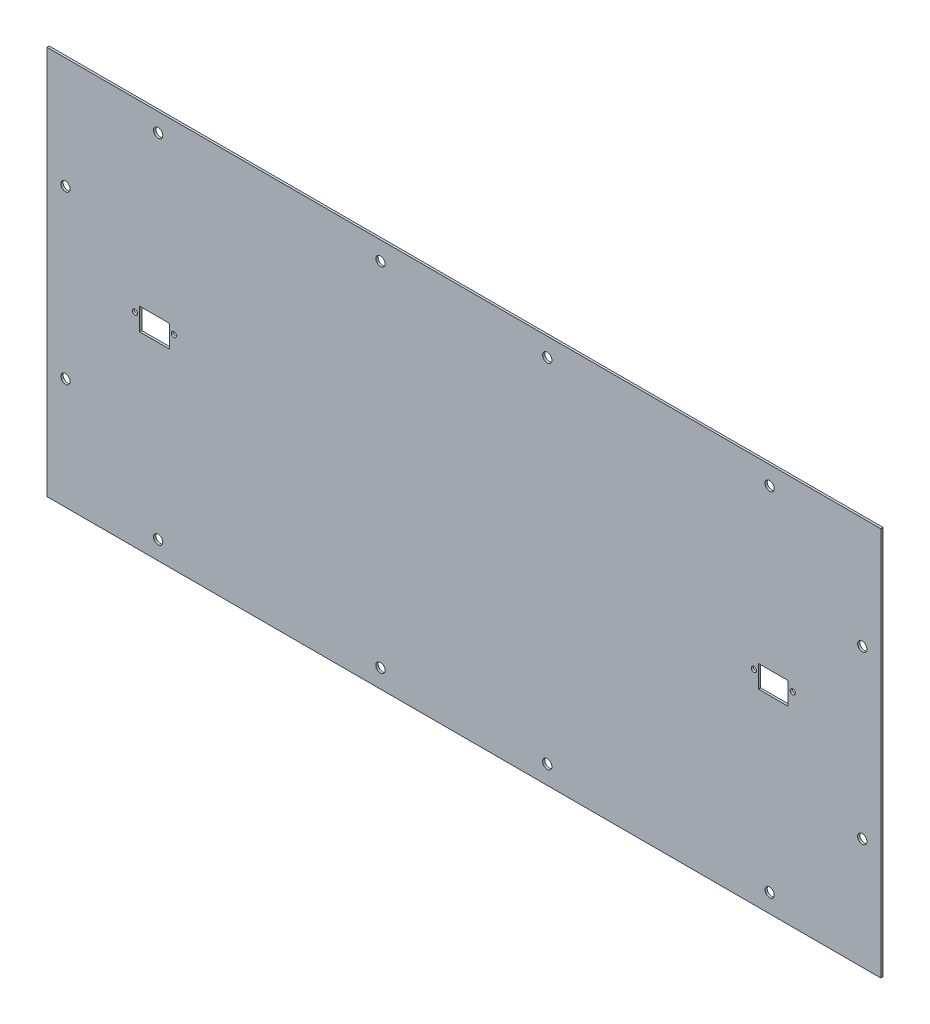
ISO-10303-21;
HEADER;
FILE_DESCRIPTION(('STEP AP214'),'2;1');
FILE_NAME('part.step','',(''),(''),'','','');
FILE_SCHEMA(('AUTOMOTIVE_DESIGN { 1 0 10303 214 1 1 1 1 }'));
ENDSEC;
DATA;
#1=APPLICATION_CONTEXT('core data for automotive mechanical design processes');
#2=APPLICATION_PROTOCOL_DEFINITION('international standard','automotive_design',2000,#1);
#3=PRODUCT_CONTEXT('',#1,'mechanical');
#4=PRODUCT('Part','Part','',(#3));
#5=PRODUCT_RELATED_PRODUCT_CATEGORY('part','',(#4));
#6=PRODUCT_DEFINITION_FORMATION('','',#4);
#7=PRODUCT_DEFINITION_CONTEXT('part definition',#1,'design');
#8=PRODUCT_DEFINITION('design','',#6,#7);
#9=PRODUCT_DEFINITION_SHAPE('','',#8);
#10=(LENGTH_UNIT() NAMED_UNIT(*) SI_UNIT(.MILLI.,.METRE.));
#11=(NAMED_UNIT(*) PLANE_ANGLE_UNIT() SI_UNIT($,.RADIAN.));
#12=(NAMED_UNIT(*) SI_UNIT($,.STERADIAN.) SOLID_ANGLE_UNIT());
#13=UNCERTAINTY_MEASURE_WITH_UNIT(LENGTH_MEASURE(1.E-05),#10,'distance_accuracy_value','');
#14=(GEOMETRIC_REPRESENTATION_CONTEXT(3) GLOBAL_UNCERTAINTY_ASSIGNED_CONTEXT((#13)) GLOBAL_UNIT_ASSIGNED_CONTEXT((#10,
#11,#12)) REPRESENTATION_CONTEXT('',''));
#15=CARTESIAN_POINT('',(0.,0.,0.));
#16=DIRECTION('',(0.,0.,1.));
#17=DIRECTION('',(1.,0.,0.));
#18=AXIS2_PLACEMENT_3D('',#15,#16,#17);
#19=CARTESIAN_POINT('',(0.,0.,-1.2));
#20=DIRECTION('',(0.,0.,-1.));
#21=DIRECTION('',(-1.,0.,0.));
#22=AXIS2_PLACEMENT_3D('',#19,#20,#21);
#23=PLANE('',#22);
#24=CARTESIAN_POINT('',(440.,60.0000000000001,-1.2));
#25=DIRECTION('',(0.,0.,1.));
#26=DIRECTION('',(1.,0.,0.));
#27=AXIS2_PLACEMENT_3D('',#24,#25,#26);
#28=CIRCLE('',#27,2.50000000000002);
#29=CARTESIAN_POINT('',(442.5,60.0000000000001,-1.2));
#30=VERTEX_POINT('',#29);
#31=EDGE_CURVE('E291',#30,#30,#28,.T.);
#32=ORIENTED_EDGE('',*,*,#31,.T.);
#33=EDGE_LOOP('',(#32));
#34=FACE_BOUND('',#33,.T.);
#35=CARTESIAN_POINT('',(180.,200.,-1.2));
#36=DIRECTION('',(0.,0.,1.));
#37=DIRECTION('',(1.,0.,0.));
#38=AXIS2_PLACEMENT_3D('',#35,#36,#37);
#39=CIRCLE('',#38,2.50000000000002);
#40=CARTESIAN_POINT('',(182.5,200.,-1.2));
#41=VERTEX_POINT('',#40);
#42=EDGE_CURVE('E303',#41,#41,#39,.T.);
#43=ORIENTED_EDGE('',*,*,#42,.T.);
#44=EDGE_LOOP('',(#43));
#45=FACE_BOUND('',#44,.T.);
#46=CARTESIAN_POINT('',(60.,200.,-1.2));
#47=DIRECTION('',(0.,0.,1.));
#48=DIRECTION('',(1.,0.,0.));
#49=AXIS2_PLACEMENT_3D('',#46,#47,#48);
#50=CIRCLE('',#49,2.5);
#51=CARTESIAN_POINT('',(62.5,200.,-1.2));
#52=VERTEX_POINT('',#51);
#53=EDGE_CURVE('E306',#52,#52,#50,.T.);
#54=ORIENTED_EDGE('',*,*,#53,.T.);
#55=EDGE_LOOP('',(#54));
#56=FACE_BOUND('',#55,.T.);
#57=CARTESIAN_POINT('',(10.,150.,-1.2));
#58=DIRECTION('',(0.,0.,1.));
#59=DIRECTION('',(1.,0.,0.));
#60=AXIS2_PLACEMENT_3D('',#57,#58,#59);
#61=CIRCLE('',#60,2.50000000000002);
#62=CARTESIAN_POINT('',(12.5,150.,-1.2));
#63=VERTEX_POINT('',#62);
#64=EDGE_CURVE('E309',#63,#63,#61,.T.);
#65=ORIENTED_EDGE('',*,*,#64,.T.);
#66=EDGE_LOOP('',(#65));
#67=FACE_BOUND('',#66,.T.);
#68=CARTESIAN_POINT('',(270.,10.,-1.2));
#69=DIRECTION('',(0.,0.,1.));
#70=DIRECTION('',(1.,0.,0.));
#71=AXIS2_PLACEMENT_3D('',#68,#69,#70);
#72=CIRCLE('',#71,2.50000000000002);
#73=CARTESIAN_POINT('',(272.5,10.,-1.2));
#74=VERTEX_POINT('',#73);
#75=EDGE_CURVE('E290',#74,#74,#72,.T.);
#76=ORIENTED_EDGE('',*,*,#75,.T.);
#77=EDGE_LOOP('',(#76));
#78=FACE_BOUND('',#77,.T.);
#79=CARTESIAN_POINT('',(390.,10.0000000000001,-1.2));
#80=DIRECTION('',(0.,0.,1.));
#81=DIRECTION('',(1.,0.,0.));
#82=AXIS2_PLACEMENT_3D('',#79,#80,#81);
#83=CIRCLE('',#82,2.50000000000002);
#84=CARTESIAN_POINT('',(392.5,10.0000000000001,-1.2));
#85=VERTEX_POINT('',#84);
#86=EDGE_CURVE('E241',#85,#85,#83,.T.);
#87=ORIENTED_EDGE('',*,*,#86,.T.);
#88=EDGE_LOOP('',(#87));
#89=FACE_BOUND('',#88,.T.);
#90=CARTESIAN_POINT('',(402.5,110.,-1.2));
#91=DIRECTION('',(0.,0.,-1.));
#92=DIRECTION('',(-1.,0.,0.));
#93=AXIS2_PLACEMENT_3D('',#90,#91,#92);
#94=CIRCLE('',#93,1.40000000000003);
#95=CARTESIAN_POINT('',(401.1,110.,-1.2));
#96=VERTEX_POINT('',#95);
#97=EDGE_CURVE('E229',#96,#96,#94,.T.);
#98=ORIENTED_EDGE('',*,*,#97,.F.);
#99=EDGE_LOOP('',(#98));
#100=FACE_BOUND('',#99,.T.);
#101=CARTESIAN_POINT('',(381.5,110.,-1.2));
#102=DIRECTION('',(0.,0.,-1.));
#103=DIRECTION('',(-1.,0.,0.));
#104=AXIS2_PLACEMENT_3D('',#101,#102,#103);
#105=CIRCLE('',#104,1.40000000000003);
#106=CARTESIAN_POINT('',(380.1,110.,-1.2));
#107=VERTEX_POINT('',#106);
#108=EDGE_CURVE('E281',#107,#107,#105,.T.);
#109=ORIENTED_EDGE('',*,*,#108,.F.);
#110=EDGE_LOOP('',(#109));
#111=FACE_BOUND('',#110,.T.);
#112=CARTESIAN_POINT('',(68.5,110.,-1.2));
#113=DIRECTION('',(0.,0.,-1.));
#114=DIRECTION('',(1.,0.,0.));
#115=AXIS2_PLACEMENT_3D('',#112,#113,#114);
#116=CIRCLE('',#115,1.40000000000003);
#117=CARTESIAN_POINT('',(69.9,110.,-1.2));
#118=VERTEX_POINT('',#117);
#119=EDGE_CURVE('E276',#118,#118,#116,.T.);
#120=ORIENTED_EDGE('',*,*,#119,.F.);
#121=EDGE_LOOP('',(#120));
#122=FACE_BOUND('',#121,.T.);
#123=CARTESIAN_POINT('',(47.5,110.,-1.2));
#124=DIRECTION('',(0.,0.,-1.));
#125=DIRECTION('',(1.,0.,0.));
#126=AXIS2_PLACEMENT_3D('',#123,#124,#125);
#127=CIRCLE('',#126,1.40000000000003);
#128=CARTESIAN_POINT('',(48.9,110.,-1.2));
#129=VERTEX_POINT('',#128);
#130=EDGE_CURVE('E272',#129,#129,#127,.T.);
#131=ORIENTED_EDGE('',*,*,#130,.F.);
#132=EDGE_LOOP('',(#131));
#133=FACE_BOUND('',#132,.T.);
#134=DIRECTION('',(0.,-1.,0.));
#135=VECTOR('',#134,1.);
#136=CARTESIAN_POINT('',(400.,114.,-1.2));
#137=LINE('',#136,#135);
#138=CARTESIAN_POINT('',(400.,114.,-1.2));
#139=VERTEX_POINT('',#138);
#140=CARTESIAN_POINT('',(400.,102.,-1.2));
#141=VERTEX_POINT('',#140);
#142=EDGE_CURVE('E51',#139,#141,#137,.T.);
#143=ORIENTED_EDGE('',*,*,#142,.F.);
#144=DIRECTION('',(1.,0.,0.));
#145=VECTOR('',#144,1.);
#146=CARTESIAN_POINT('',(400.,114.,-1.2));
#147=LINE('',#146,#145);
#148=CARTESIAN_POINT('',(384.,114.,-1.2));
#149=VERTEX_POINT('',#148);
#150=EDGE_CURVE('E148',#149,#139,#147,.T.);
#151=ORIENTED_EDGE('',*,*,#150,.F.);
#152=DIRECTION('',(0.,1.,0.));
#153=VECTOR('',#152,1.);
#154=CARTESIAN_POINT('',(384.,114.,-1.2));
#155=LINE('',#154,#153);
#156=CARTESIAN_POINT('',(384.,102.,-1.2));
#157=VERTEX_POINT('',#156);
#158=EDGE_CURVE('E132',#157,#149,#155,.T.);
#159=ORIENTED_EDGE('',*,*,#158,.F.);
#160=DIRECTION('',(-1.,0.,0.));
#161=VECTOR('',#160,1.);
#162=CARTESIAN_POINT('',(400.,102.,-1.2));
#163=LINE('',#162,#161);
#164=EDGE_CURVE('E142',#141,#157,#163,.T.);
#165=ORIENTED_EDGE('',*,*,#164,.F.);
#166=EDGE_LOOP('',(#143,#151,#159,#165));
#167=FACE_BOUND('',#166,.T.);
#168=DIRECTION('',(1.,0.,0.));
#169=VECTOR('',#168,1.);
#170=CARTESIAN_POINT('',(50.,114.,-1.2));
#171=LINE('',#170,#169);
#172=CARTESIAN_POINT('',(50.,114.,-1.2));
#173=VERTEX_POINT('',#172);
#174=CARTESIAN_POINT('',(66.,114.,-1.2));
#175=VERTEX_POINT('',#174);
#176=EDGE_CURVE('E59',#173,#175,#171,.T.);
#177=ORIENTED_EDGE('',*,*,#176,.F.);
#178=DIRECTION('',(0.,1.,0.));
#179=VECTOR('',#178,1.);
#180=CARTESIAN_POINT('',(50.,114.,-1.2));
#181=LINE('',#180,#179);
#182=CARTESIAN_POINT('',(50.,102.,-1.2));
#183=VERTEX_POINT('',#182);
#184=EDGE_CURVE('E166',#183,#173,#181,.T.);
#185=ORIENTED_EDGE('',*,*,#184,.F.);
#186=DIRECTION('',(-1.,0.,0.));
#187=VECTOR('',#186,1.);
#188=CARTESIAN_POINT('',(50.,102.,-1.2));
#189=LINE('',#188,#187);
#190=CARTESIAN_POINT('',(66.,102.,-1.2));
#191=VERTEX_POINT('',#190);
#192=EDGE_CURVE('E163',#191,#183,#189,.T.);
#193=ORIENTED_EDGE('',*,*,#192,.F.);
#194=DIRECTION('',(0.,-1.,0.));
#195=VECTOR('',#194,1.);
#196=CARTESIAN_POINT('',(66.,114.,-1.2));
#197=LINE('',#196,#195);
#198=EDGE_CURVE('E159',#175,#191,#197,.T.);
#199=ORIENTED_EDGE('',*,*,#198,.F.);
#200=EDGE_LOOP('',(#177,#185,#193,#199));
#201=FACE_BOUND('',#200,.T.);
#202=DIRECTION('',(0.,1.,0.));
#203=VECTOR('',#202,1.);
#204=CARTESIAN_POINT('',(450.,0.,-1.2));
#205=LINE('',#204,#203);
#206=CARTESIAN_POINT('',(450.,0.,-1.2));
#207=VERTEX_POINT('',#206);
#208=CARTESIAN_POINT('',(450.,210.,-1.2));
#209=VERTEX_POINT('',#208);
#210=EDGE_CURVE('E177',#207,#209,#205,.T.);
#211=ORIENTED_EDGE('',*,*,#210,.F.);
#212=DIRECTION('',(-1.,0.,0.));
#213=VECTOR('',#212,1.);
#214=CARTESIAN_POINT('',(0.,0.,-1.2));
#215=LINE('',#214,#213);
#216=CARTESIAN_POINT('',(0.,0.,-1.2));
#217=VERTEX_POINT('',#216);
#218=EDGE_CURVE('E180',#217,#207,#215,.F.);
#219=ORIENTED_EDGE('',*,*,#218,.F.);
#220=DIRECTION('',(0.,1.,0.));
#221=VECTOR('',#220,1.);
#222=CARTESIAN_POINT('',(0.,0.,-1.2));
#223=LINE('',#222,#221);
#224=CARTESIAN_POINT('',(0.,210.,-1.2));
#225=VERTEX_POINT('',#224);
#226=EDGE_CURVE('E186',#217,#225,#223,.T.);
#227=ORIENTED_EDGE('',*,*,#226,.T.);
#228=DIRECTION('',(-1.,0.,0.));
#229=VECTOR('',#228,1.);
#230=CARTESIAN_POINT('',(0.,210.,-1.2));
#231=LINE('',#230,#229);
#232=EDGE_CURVE('E182',#225,#209,#231,.F.);
#233=ORIENTED_EDGE('',*,*,#232,.T.);
#234=EDGE_LOOP('',(#211,#219,#227,#233));
#235=FACE_BOUND('',#234,.T.);
#236=CARTESIAN_POINT('',(180.,10.0000000000001,-1.2));
#237=DIRECTION('',(0.,0.,-1.));
#238=DIRECTION('',(-1.,0.,0.));
#239=AXIS2_PLACEMENT_3D('',#236,#237,#238);
#240=CIRCLE('',#239,2.50000000000002);
#241=CARTESIAN_POINT('',(177.5,10.0000000000001,-1.2));
#242=VERTEX_POINT('',#241);
#243=EDGE_CURVE('E318',#242,#242,#240,.T.);
#244=ORIENTED_EDGE('',*,*,#243,.F.);
#245=EDGE_LOOP('',(#244));
#246=FACE_BOUND('',#245,.T.);
#247=CARTESIAN_POINT('',(60.,10.0000000000001,-1.2));
#248=DIRECTION('',(0.,0.,-1.));
#249=DIRECTION('',(-1.,0.,0.));
#250=AXIS2_PLACEMENT_3D('',#247,#248,#249);
#251=CIRCLE('',#250,2.5);
#252=CARTESIAN_POINT('',(57.5,10.0000000000001,-1.2));
#253=VERTEX_POINT('',#252);
#254=EDGE_CURVE('E315',#253,#253,#251,.T.);
#255=ORIENTED_EDGE('',*,*,#254,.F.);
#256=EDGE_LOOP('',(#255));
#257=FACE_BOUND('',#256,.T.);
#258=CARTESIAN_POINT('',(10.,60.0000000000001,-1.2));
#259=DIRECTION('',(0.,0.,-1.));
#260=DIRECTION('',(-1.,0.,0.));
#261=AXIS2_PLACEMENT_3D('',#258,#259,#260);
#262=CIRCLE('',#261,2.50000000000002);
#263=CARTESIAN_POINT('',(7.49999999999998,60.0000000000001,-1.2));
#264=VERTEX_POINT('',#263);
#265=EDGE_CURVE('E312',#264,#264,#262,.T.);
#266=ORIENTED_EDGE('',*,*,#265,.F.);
#267=EDGE_LOOP('',(#266));
#268=FACE_BOUND('',#267,.T.);
#269=CARTESIAN_POINT('',(270.,200.,-1.2));
#270=DIRECTION('',(0.,0.,-1.));
#271=DIRECTION('',(-1.,0.,0.));
#272=AXIS2_PLACEMENT_3D('',#269,#270,#271);
#273=CIRCLE('',#272,2.50000000000002);
#274=CARTESIAN_POINT('',(267.5,200.,-1.2));
#275=VERTEX_POINT('',#274);
#276=EDGE_CURVE('E300',#275,#275,#273,.T.);
#277=ORIENTED_EDGE('',*,*,#276,.F.);
#278=EDGE_LOOP('',(#277));
#279=FACE_BOUND('',#278,.T.);
#280=CARTESIAN_POINT('',(390.,200.,-1.2));
#281=DIRECTION('',(0.,0.,-1.));
#282=DIRECTION('',(-1.,0.,0.));
#283=AXIS2_PLACEMENT_3D('',#280,#281,#282);
#284=CIRCLE('',#283,2.50000000000002);
#285=CARTESIAN_POINT('',(387.5,200.,-1.2));
#286=VERTEX_POINT('',#285);
#287=EDGE_CURVE('E297',#286,#286,#284,.T.);
#288=ORIENTED_EDGE('',*,*,#287,.F.);
#289=EDGE_LOOP('',(#288));
#290=FACE_BOUND('',#289,.T.);
#291=CARTESIAN_POINT('',(440.,150.,-1.2));
#292=DIRECTION('',(0.,0.,-1.));
#293=DIRECTION('',(-1.,0.,0.));
#294=AXIS2_PLACEMENT_3D('',#291,#292,#293);
#295=CIRCLE('',#294,2.50000000000002);
#296=CARTESIAN_POINT('',(437.5,150.,-1.2));
#297=VERTEX_POINT('',#296);
#298=EDGE_CURVE('E294',#297,#297,#295,.T.);
#299=ORIENTED_EDGE('',*,*,#298,.F.);
#300=EDGE_LOOP('',(#299));
#301=FACE_BOUND('',#300,.T.);
#302=ADVANCED_FACE('F34',(#34,#45,#56,#67,#78,#89,#100,#111,#122,#133,#167,#201,#235,#246,#257,
#268,#279,#290,#301),#23,.T.);
#303=CARTESIAN_POINT('',(0.,0.,0.));
#304=DIRECTION('',(0.,0.,-1.));
#305=DIRECTION('',(-1.,0.,0.));
#306=AXIS2_PLACEMENT_3D('',#303,#304,#305);
#307=PLANE('',#306);
#308=CARTESIAN_POINT('',(440.,60.0000000000001,0.));
#309=DIRECTION('',(0.,0.,-1.));
#310=DIRECTION('',(-1.,0.,0.));
#311=AXIS2_PLACEMENT_3D('',#308,#309,#310);
#312=CIRCLE('',#311,2.50000000000002);
#313=CARTESIAN_POINT('',(437.5,60.0000000000001,0.));
#314=VERTEX_POINT('',#313);
#315=EDGE_CURVE('E38',#314,#314,#312,.F.);
#316=ORIENTED_EDGE('',*,*,#315,.F.);
#317=EDGE_LOOP('',(#316));
#318=FACE_BOUND('',#317,.T.);
#319=CARTESIAN_POINT('',(390.,200.,0.));
#320=DIRECTION('',(0.,0.,-1.));
#321=DIRECTION('',(-1.,0.,0.));
#322=AXIS2_PLACEMENT_3D('',#319,#320,#321);
#323=CIRCLE('',#322,2.50000000000002);
#324=CARTESIAN_POINT('',(387.5,200.,0.));
#325=VERTEX_POINT('',#324);
#326=EDGE_CURVE('E265',#325,#325,#323,.T.);
#327=ORIENTED_EDGE('',*,*,#326,.T.);
#328=EDGE_LOOP('',(#327));
#329=FACE_BOUND('',#328,.T.);
#330=CARTESIAN_POINT('',(10.,60.0000000000001,0.));
#331=DIRECTION('',(0.,0.,-1.));
#332=DIRECTION('',(-1.,0.,0.));
#333=AXIS2_PLACEMENT_3D('',#330,#331,#332);
#334=CIRCLE('',#333,2.50000000000002);
#335=CARTESIAN_POINT('',(7.49999999999998,60.0000000000001,0.));
#336=VERTEX_POINT('',#335);
#337=EDGE_CURVE('E250',#336,#336,#334,.T.);
#338=ORIENTED_EDGE('',*,*,#337,.T.);
#339=EDGE_LOOP('',(#338));
#340=FACE_BOUND('',#339,.T.);
#341=CARTESIAN_POINT('',(180.,10.0000000000001,0.));
#342=DIRECTION('',(0.,0.,-1.));
#343=DIRECTION('',(-1.,0.,0.));
#344=AXIS2_PLACEMENT_3D('',#341,#342,#343);
#345=CIRCLE('',#344,2.50000000000002);
#346=CARTESIAN_POINT('',(177.5,10.0000000000001,0.));
#347=VERTEX_POINT('',#346);
#348=EDGE_CURVE('E244',#347,#347,#345,.T.);
#349=ORIENTED_EDGE('',*,*,#348,.T.);
#350=EDGE_LOOP('',(#349));
#351=FACE_BOUND('',#350,.T.);
#352=CARTESIAN_POINT('',(270.,10.,0.));
#353=DIRECTION('',(0.,0.,-1.));
#354=DIRECTION('',(-1.,0.,0.));
#355=AXIS2_PLACEMENT_3D('',#352,#353,#354);
#356=CIRCLE('',#355,2.50000000000002);
#357=CARTESIAN_POINT('',(267.5,10.,0.));
#358=VERTEX_POINT('',#357);
#359=EDGE_CURVE('E240',#358,#358,#356,.F.);
#360=ORIENTED_EDGE('',*,*,#359,.F.);
#361=EDGE_LOOP('',(#360));
#362=FACE_BOUND('',#361,.T.);
#363=CARTESIAN_POINT('',(390.,10.0000000000001,0.));
#364=DIRECTION('',(0.,0.,-1.));
#365=DIRECTION('',(-1.,0.,0.));
#366=AXIS2_PLACEMENT_3D('',#363,#364,#365);
#367=CIRCLE('',#366,2.50000000000002);
#368=CARTESIAN_POINT('',(387.5,10.0000000000001,0.));
#369=VERTEX_POINT('',#368);
#370=EDGE_CURVE('E237',#369,#369,#367,.F.);
#371=ORIENTED_EDGE('',*,*,#370,.F.);
#372=EDGE_LOOP('',(#371));
#373=FACE_BOUND('',#372,.T.);
#374=CARTESIAN_POINT('',(402.5,110.,0.));
#375=DIRECTION('',(0.,0.,-1.));
#376=DIRECTION('',(-1.,0.,0.));
#377=AXIS2_PLACEMENT_3D('',#374,#375,#376);
#378=CIRCLE('',#377,1.40000000000003);
#379=CARTESIAN_POINT('',(401.1,110.,0.));
#380=VERTEX_POINT('',#379);
#381=EDGE_CURVE('E160',#380,#380,#378,.T.);
#382=ORIENTED_EDGE('',*,*,#381,.T.);
#383=EDGE_LOOP('',(#382));
#384=FACE_BOUND('',#383,.T.);
#385=CARTESIAN_POINT('',(381.5,110.,0.));
#386=DIRECTION('',(0.,0.,-1.));
#387=DIRECTION('',(-1.,0.,0.));
#388=AXIS2_PLACEMENT_3D('',#385,#386,#387);
#389=CIRCLE('',#388,1.40000000000003);
#390=CARTESIAN_POINT('',(380.1,110.,0.));
#391=VERTEX_POINT('',#390);
#392=EDGE_CURVE('E232',#391,#391,#389,.T.);
#393=ORIENTED_EDGE('',*,*,#392,.T.);
#394=EDGE_LOOP('',(#393));
#395=FACE_BOUND('',#394,.T.);
#396=CARTESIAN_POINT('',(68.5,110.,0.));
#397=DIRECTION('',(0.,0.,-1.));
#398=DIRECTION('',(-1.,0.,0.));
#399=AXIS2_PLACEMENT_3D('',#396,#397,#398);
#400=CIRCLE('',#399,1.40000000000003);
#401=CARTESIAN_POINT('',(67.1,110.,0.));
#402=VERTEX_POINT('',#401);
#403=EDGE_CURVE('E228',#402,#402,#400,.T.);
#404=ORIENTED_EDGE('',*,*,#403,.T.);
#405=EDGE_LOOP('',(#404));
#406=FACE_BOUND('',#405,.T.);
#407=CARTESIAN_POINT('',(47.5,110.,0.));
#408=DIRECTION('',(0.,0.,-1.));
#409=DIRECTION('',(-1.,0.,0.));
#410=AXIS2_PLACEMENT_3D('',#407,#408,#409);
#411=CIRCLE('',#410,1.40000000000003);
#412=CARTESIAN_POINT('',(46.1,110.,0.));
#413=VERTEX_POINT('',#412);
#414=EDGE_CURVE('E225',#413,#413,#411,.T.);
#415=ORIENTED_EDGE('',*,*,#414,.T.);
#416=EDGE_LOOP('',(#415));
#417=FACE_BOUND('',#416,.T.);
#418=DIRECTION('',(1.,0.,0.));
#419=VECTOR('',#418,1.);
#420=CARTESIAN_POINT('',(0.,114.,0.));
#421=LINE('',#420,#419);
#422=CARTESIAN_POINT('',(384.,114.,0.));
#423=VERTEX_POINT('',#422);
#424=CARTESIAN_POINT('',(400.,114.,0.));
#425=VERTEX_POINT('',#424);
#426=EDGE_CURVE('E43',#423,#425,#421,.T.);
#427=ORIENTED_EDGE('',*,*,#426,.T.);
#428=DIRECTION('',(0.,-1.,0.));
#429=VECTOR('',#428,1.);
#430=CARTESIAN_POINT('',(400.,0.,0.));
#431=LINE('',#430,#429);
#432=CARTESIAN_POINT('',(400.,102.,0.));
#433=VERTEX_POINT('',#432);
#434=EDGE_CURVE('E11',#425,#433,#431,.T.);
#435=ORIENTED_EDGE('',*,*,#434,.T.);
#436=DIRECTION('',(-1.,0.,0.));
#437=VECTOR('',#436,1.);
#438=CARTESIAN_POINT('',(0.,102.,0.));
#439=LINE('',#438,#437);
#440=CARTESIAN_POINT('',(384.,102.,0.));
#441=VERTEX_POINT('',#440);
#442=EDGE_CURVE('E220',#433,#441,#439,.T.);
#443=ORIENTED_EDGE('',*,*,#442,.T.);
#444=DIRECTION('',(0.,1.,0.));
#445=VECTOR('',#444,1.);
#446=CARTESIAN_POINT('',(384.,0.,0.));
#447=LINE('',#446,#445);
#448=EDGE_CURVE('E135',#441,#423,#447,.T.);
#449=ORIENTED_EDGE('',*,*,#448,.T.);
#450=EDGE_LOOP('',(#427,#435,#443,#449));
#451=FACE_BOUND('',#450,.T.);
#452=DIRECTION('',(0.,1.,0.));
#453=VECTOR('',#452,1.);
#454=CARTESIAN_POINT('',(50.,0.,0.));
#455=LINE('',#454,#453);
#456=CARTESIAN_POINT('',(50.,102.,0.));
#457=VERTEX_POINT('',#456);
#458=CARTESIAN_POINT('',(50.,114.,0.));
#459=VERTEX_POINT('',#458);
#460=EDGE_CURVE('E214',#457,#459,#455,.T.);
#461=ORIENTED_EDGE('',*,*,#460,.T.);
#462=DIRECTION('',(1.,0.,0.));
#463=VECTOR('',#462,1.);
#464=CARTESIAN_POINT('',(0.,114.,0.));
#465=LINE('',#464,#463);
#466=CARTESIAN_POINT('',(66.,114.,0.));
#467=VERTEX_POINT('',#466);
#468=EDGE_CURVE('E217',#459,#467,#465,.T.);
#469=ORIENTED_EDGE('',*,*,#468,.T.);
#470=DIRECTION('',(0.,-1.,0.));
#471=VECTOR('',#470,1.);
#472=CARTESIAN_POINT('',(66.,0.,0.));
#473=LINE('',#472,#471);
#474=CARTESIAN_POINT('',(66.,102.,0.));
#475=VERTEX_POINT('',#474);
#476=EDGE_CURVE('E207',#467,#475,#473,.T.);
#477=ORIENTED_EDGE('',*,*,#476,.T.);
#478=DIRECTION('',(-1.,0.,0.));
#479=VECTOR('',#478,1.);
#480=CARTESIAN_POINT('',(0.,102.,0.));
#481=LINE('',#480,#479);
#482=EDGE_CURVE('E211',#475,#457,#481,.T.);
#483=ORIENTED_EDGE('',*,*,#482,.T.);
#484=EDGE_LOOP('',(#461,#469,#477,#483));
#485=FACE_BOUND('',#484,.T.);
#486=DIRECTION('',(0.,1.,0.));
#487=VECTOR('',#486,1.);
#488=CARTESIAN_POINT('',(450.,0.,0.));
#489=LINE('',#488,#487);
#490=CARTESIAN_POINT('',(450.,0.,0.));
#491=VERTEX_POINT('',#490);
#492=CARTESIAN_POINT('',(450.,210.,0.));
#493=VERTEX_POINT('',#492);
#494=EDGE_CURVE('E155',#491,#493,#489,.T.);
#495=ORIENTED_EDGE('',*,*,#494,.T.);
#496=DIRECTION('',(1.,0.,0.));
#497=VECTOR('',#496,1.);
#498=CARTESIAN_POINT('',(0.,210.,0.));
#499=LINE('',#498,#497);
#500=CARTESIAN_POINT('',(0.,210.,0.));
#501=VERTEX_POINT('',#500);
#502=EDGE_CURVE('E181',#501,#493,#499,.T.);
#503=ORIENTED_EDGE('',*,*,#502,.F.);
#504=DIRECTION('',(0.,1.,0.));
#505=VECTOR('',#504,1.);
#506=CARTESIAN_POINT('',(0.,0.,0.));
#507=LINE('',#506,#505);
#508=CARTESIAN_POINT('',(0.,0.,0.));
#509=VERTEX_POINT('',#508);
#510=EDGE_CURVE('E191',#509,#501,#507,.T.);
#511=ORIENTED_EDGE('',*,*,#510,.F.);
#512=DIRECTION('',(1.,0.,0.));
#513=VECTOR('',#512,1.);
#514=CARTESIAN_POINT('',(0.,0.,0.));
#515=LINE('',#514,#513);
#516=EDGE_CURVE('E194',#509,#491,#515,.T.);
#517=ORIENTED_EDGE('',*,*,#516,.T.);
#518=EDGE_LOOP('',(#495,#503,#511,#517));
#519=FACE_BOUND('',#518,.T.);
#520=CARTESIAN_POINT('',(60.,10.0000000000001,0.));
#521=DIRECTION('',(0.,0.,-1.));
#522=DIRECTION('',(-1.,0.,0.));
#523=AXIS2_PLACEMENT_3D('',#520,#521,#522);
#524=CIRCLE('',#523,2.5);
#525=CARTESIAN_POINT('',(57.5,10.0000000000001,0.));
#526=VERTEX_POINT('',#525);
#527=EDGE_CURVE('E247',#526,#526,#524,.T.);
#528=ORIENTED_EDGE('',*,*,#527,.T.);
#529=EDGE_LOOP('',(#528));
#530=FACE_BOUND('',#529,.T.);
#531=CARTESIAN_POINT('',(10.,150.,0.));
#532=DIRECTION('',(0.,0.,-1.));
#533=DIRECTION('',(-1.,0.,0.));
#534=AXIS2_PLACEMENT_3D('',#531,#532,#533);
#535=CIRCLE('',#534,2.50000000000002);
#536=CARTESIAN_POINT('',(7.49999999999999,150.,0.));
#537=VERTEX_POINT('',#536);
#538=EDGE_CURVE('E253',#537,#537,#535,.F.);
#539=ORIENTED_EDGE('',*,*,#538,.F.);
#540=EDGE_LOOP('',(#539));
#541=FACE_BOUND('',#540,.T.);
#542=CARTESIAN_POINT('',(60.,200.,0.));
#543=DIRECTION('',(0.,0.,-1.));
#544=DIRECTION('',(-1.,0.,0.));
#545=AXIS2_PLACEMENT_3D('',#542,#543,#544);
#546=CIRCLE('',#545,2.5);
#547=CARTESIAN_POINT('',(57.5,200.,0.));
#548=VERTEX_POINT('',#547);
#549=EDGE_CURVE('E256',#548,#548,#546,.F.);
#550=ORIENTED_EDGE('',*,*,#549,.F.);
#551=EDGE_LOOP('',(#550));
#552=FACE_BOUND('',#551,.T.);
#553=CARTESIAN_POINT('',(180.,200.,0.));
#554=DIRECTION('',(0.,0.,-1.));
#555=DIRECTION('',(-1.,0.,0.));
#556=AXIS2_PLACEMENT_3D('',#553,#554,#555);
#557=CIRCLE('',#556,2.50000000000002);
#558=CARTESIAN_POINT('',(177.5,200.,0.));
#559=VERTEX_POINT('',#558);
#560=EDGE_CURVE('E259',#559,#559,#557,.F.);
#561=ORIENTED_EDGE('',*,*,#560,.F.);
#562=EDGE_LOOP('',(#561));
#563=FACE_BOUND('',#562,.T.);
#564=CARTESIAN_POINT('',(270.,200.,0.));
#565=DIRECTION('',(0.,0.,-1.));
#566=DIRECTION('',(-1.,0.,0.));
#567=AXIS2_PLACEMENT_3D('',#564,#565,#566);
#568=CIRCLE('',#567,2.50000000000002);
#569=CARTESIAN_POINT('',(267.5,200.,0.));
#570=VERTEX_POINT('',#569);
#571=EDGE_CURVE('E262',#570,#570,#568,.T.);
#572=ORIENTED_EDGE('',*,*,#571,.T.);
#573=EDGE_LOOP('',(#572));
#574=FACE_BOUND('',#573,.T.);
#575=CARTESIAN_POINT('',(440.,150.,0.));
#576=DIRECTION('',(0.,0.,-1.));
#577=DIRECTION('',(-1.,0.,0.));
#578=AXIS2_PLACEMENT_3D('',#575,#576,#577);
#579=CIRCLE('',#578,2.50000000000002);
#580=CARTESIAN_POINT('',(437.5,150.,0.));
#581=VERTEX_POINT('',#580);
#582=EDGE_CURVE('E267',#581,#581,#579,.T.);
#583=ORIENTED_EDGE('',*,*,#582,.T.);
#584=EDGE_LOOP('',(#583));
#585=FACE_BOUND('',#584,.T.);
#586=ADVANCED_FACE('F334',(#318,#329,#340,#351,#362,#373,#384,#395,#406,#417,#451,#485,#519,
#530,#541,#552,#563,#574,#585),#307,.F.);
#587=CARTESIAN_POINT('',(0.,0.,0.));
#588=DIRECTION('',(-1.,0.,0.));
#589=DIRECTION('',(0.,1.,0.));
#590=AXIS2_PLACEMENT_3D('',#587,#588,#589);
#591=PLANE('',#590);
#592=DIRECTION('',(0.,0.,-1.));
#593=VECTOR('',#592,1.);
#594=CARTESIAN_POINT('',(0.,0.,0.));
#595=LINE('',#594,#593);
#596=EDGE_CURVE('E205',#509,#217,#595,.T.);
#597=ORIENTED_EDGE('',*,*,#596,.F.);
#598=ORIENTED_EDGE('',*,*,#510,.T.);
#599=DIRECTION('',(0.,0.,-1.));
#600=VECTOR('',#599,1.);
#601=CARTESIAN_POINT('',(0.,210.,0.));
#602=LINE('',#601,#600);
#603=EDGE_CURVE('E203',#501,#225,#602,.T.);
#604=ORIENTED_EDGE('',*,*,#603,.T.);
#605=ORIENTED_EDGE('',*,*,#226,.F.);
#606=EDGE_LOOP('',(#597,#598,#604,#605));
#607=FACE_BOUND('',#606,.T.);
#608=ADVANCED_FACE('F337',(#607),#591,.T.);
#609=CARTESIAN_POINT('',(0.,210.,0.));
#610=DIRECTION('',(0.,1.,0.));
#611=DIRECTION('',(1.,0.,0.));
#612=AXIS2_PLACEMENT_3D('',#609,#610,#611);
#613=PLANE('',#612);
#614=ORIENTED_EDGE('',*,*,#603,.F.);
#615=ORIENTED_EDGE('',*,*,#502,.T.);
#616=DIRECTION('',(0.,0.,-1.));
#617=VECTOR('',#616,1.);
#618=CARTESIAN_POINT('',(450.,210.,0.));
#619=LINE('',#618,#617);
#620=EDGE_CURVE('E201',#493,#209,#619,.T.);
#621=ORIENTED_EDGE('',*,*,#620,.T.);
#622=ORIENTED_EDGE('',*,*,#232,.F.);
#623=EDGE_LOOP('',(#614,#615,#621,#622));
#624=FACE_BOUND('',#623,.T.);
#625=ADVANCED_FACE('F395',(#624),#613,.T.);
#626=CARTESIAN_POINT('',(450.,0.,0.));
#627=DIRECTION('',(-1.,0.,0.));
#628=DIRECTION('',(0.,1.,0.));
#629=AXIS2_PLACEMENT_3D('',#626,#627,#628);
#630=PLANE('',#629);
#631=ORIENTED_EDGE('',*,*,#620,.F.);
#632=ORIENTED_EDGE('',*,*,#494,.F.);
#633=DIRECTION('',(0.,0.,-1.));
#634=VECTOR('',#633,1.);
#635=CARTESIAN_POINT('',(450.,0.,0.));
#636=LINE('',#635,#634);
#637=EDGE_CURVE('E185',#491,#207,#636,.T.);
#638=ORIENTED_EDGE('',*,*,#637,.T.);
#639=ORIENTED_EDGE('',*,*,#210,.T.);
#640=EDGE_LOOP('',(#631,#632,#638,#639));
#641=FACE_BOUND('',#640,.T.);
#642=ADVANCED_FACE('F392',(#641),#630,.F.);
#643=CARTESIAN_POINT('',(0.,0.,0.));
#644=DIRECTION('',(0.,1.,0.));
#645=DIRECTION('',(1.,0.,0.));
#646=AXIS2_PLACEMENT_3D('',#643,#644,#645);
#647=PLANE('',#646);
#648=ORIENTED_EDGE('',*,*,#516,.F.);
#649=ORIENTED_EDGE('',*,*,#596,.T.);
#650=ORIENTED_EDGE('',*,*,#218,.T.);
#651=ORIENTED_EDGE('',*,*,#637,.F.);
#652=EDGE_LOOP('',(#648,#649,#650,#651));
#653=FACE_BOUND('',#652,.T.);
#654=ADVANCED_FACE('F36',(#653),#647,.F.);
#655=CARTESIAN_POINT('',(50.,114.,8.8));
#656=DIRECTION('',(0.,1.,0.));
#657=DIRECTION('',(0.,0.,1.));
#658=AXIS2_PLACEMENT_3D('',#655,#656,#657);
#659=PLANE('',#658);
#660=DIRECTION('',(0.,0.,-1.));
#661=VECTOR('',#660,1.);
#662=CARTESIAN_POINT('',(50.,114.,8.8));
#663=LINE('',#662,#661);
#664=EDGE_CURVE('E170',#459,#173,#663,.T.);
#665=ORIENTED_EDGE('',*,*,#664,.T.);
#666=ORIENTED_EDGE('',*,*,#176,.T.);
#667=DIRECTION('',(0.,0.,-1.));
#668=VECTOR('',#667,1.);
#669=CARTESIAN_POINT('',(66.,114.,8.8));
#670=LINE('',#669,#668);
#671=EDGE_CURVE('E169',#467,#175,#670,.T.);
#672=ORIENTED_EDGE('',*,*,#671,.F.);
#673=ORIENTED_EDGE('',*,*,#468,.F.);
#674=EDGE_LOOP('',(#665,#666,#672,#673));
#675=FACE_BOUND('',#674,.T.);
#676=ADVANCED_FACE('F389',(#675),#659,.F.);
#677=CARTESIAN_POINT('',(50.,114.,8.8));
#678=DIRECTION('',(-1.,0.,0.));
#679=DIRECTION('',(0.,0.,1.));
#680=AXIS2_PLACEMENT_3D('',#677,#678,#679);
#681=PLANE('',#680);
#682=DIRECTION('',(0.,0.,-1.));
#683=VECTOR('',#682,1.);
#684=CARTESIAN_POINT('',(50.,102.,8.8));
#685=LINE('',#684,#683);
#686=EDGE_CURVE('E172',#457,#183,#685,.T.);
#687=ORIENTED_EDGE('',*,*,#686,.T.);
#688=ORIENTED_EDGE('',*,*,#184,.T.);
#689=ORIENTED_EDGE('',*,*,#664,.F.);
#690=ORIENTED_EDGE('',*,*,#460,.F.);
#691=EDGE_LOOP('',(#687,#688,#689,#690));
#692=FACE_BOUND('',#691,.T.);
#693=ADVANCED_FACE('F464',(#692),#681,.F.);
#694=CARTESIAN_POINT('',(50.,102.,8.8));
#695=DIRECTION('',(0.,-1.,0.));
#696=DIRECTION('',(0.,0.,-1.));
#697=AXIS2_PLACEMENT_3D('',#694,#695,#696);
#698=PLANE('',#697);
#699=DIRECTION('',(0.,0.,-1.));
#700=VECTOR('',#699,1.);
#701=CARTESIAN_POINT('',(66.,102.,8.8));
#702=LINE('',#701,#700);
#703=EDGE_CURVE('E174',#475,#191,#702,.T.);
#704=ORIENTED_EDGE('',*,*,#703,.T.);
#705=ORIENTED_EDGE('',*,*,#192,.T.);
#706=ORIENTED_EDGE('',*,*,#686,.F.);
#707=ORIENTED_EDGE('',*,*,#482,.F.);
#708=EDGE_LOOP('',(#704,#705,#706,#707));
#709=FACE_BOUND('',#708,.T.);
#710=ADVANCED_FACE('F467',(#709),#698,.F.);
#711=CARTESIAN_POINT('',(66.,114.,8.8));
#712=DIRECTION('',(1.,0.,0.));
#713=DIRECTION('',(0.,0.,-1.));
#714=AXIS2_PLACEMENT_3D('',#711,#712,#713);
#715=PLANE('',#714);
#716=ORIENTED_EDGE('',*,*,#671,.T.);
#717=ORIENTED_EDGE('',*,*,#198,.T.);
#718=ORIENTED_EDGE('',*,*,#703,.F.);
#719=ORIENTED_EDGE('',*,*,#476,.F.);
#720=EDGE_LOOP('',(#716,#717,#718,#719));
#721=FACE_BOUND('',#720,.T.);
#722=ADVANCED_FACE('F463',(#721),#715,.F.);
#723=CARTESIAN_POINT('',(400.,114.,8.8));
#724=DIRECTION('',(1.,0.,0.));
#725=DIRECTION('',(0.,0.,-1.));
#726=AXIS2_PLACEMENT_3D('',#723,#724,#725);
#727=PLANE('',#726);
#728=DIRECTION('',(0.,0.,-1.));
#729=VECTOR('',#728,1.);
#730=CARTESIAN_POINT('',(400.,114.,8.8));
#731=LINE('',#730,#729);
#732=EDGE_CURVE('E153',#425,#139,#731,.T.);
#733=ORIENTED_EDGE('',*,*,#732,.T.);
#734=ORIENTED_EDGE('',*,*,#142,.T.);
#735=DIRECTION('',(0.,0.,-1.));
#736=VECTOR('',#735,1.);
#737=CARTESIAN_POINT('',(400.,102.,8.8));
#738=LINE('',#737,#736);
#739=EDGE_CURVE('E139',#433,#141,#738,.T.);
#740=ORIENTED_EDGE('',*,*,#739,.F.);
#741=ORIENTED_EDGE('',*,*,#434,.F.);
#742=EDGE_LOOP('',(#733,#734,#740,#741));
#743=FACE_BOUND('',#742,.T.);
#744=ADVANCED_FACE('F455',(#743),#727,.F.);
#745=CARTESIAN_POINT('',(400.,114.,8.8));
#746=DIRECTION('',(0.,1.,0.));
#747=DIRECTION('',(0.,0.,1.));
#748=AXIS2_PLACEMENT_3D('',#745,#746,#747);
#749=PLANE('',#748);
#750=DIRECTION('',(0.,0.,-1.));
#751=VECTOR('',#750,1.);
#752=CARTESIAN_POINT('',(384.,114.,8.8));
#753=LINE('',#752,#751);
#754=EDGE_CURVE('E138',#423,#149,#753,.T.);
#755=ORIENTED_EDGE('',*,*,#754,.T.);
#756=ORIENTED_EDGE('',*,*,#150,.T.);
#757=ORIENTED_EDGE('',*,*,#732,.F.);
#758=ORIENTED_EDGE('',*,*,#426,.F.);
#759=EDGE_LOOP('',(#755,#756,#757,#758));
#760=FACE_BOUND('',#759,.T.);
#761=ADVANCED_FACE('F452',(#760),#749,.F.);
#762=CARTESIAN_POINT('',(384.,114.,8.8));
#763=DIRECTION('',(-1.,0.,0.));
#764=DIRECTION('',(0.,0.,1.));
#765=AXIS2_PLACEMENT_3D('',#762,#763,#764);
#766=PLANE('',#765);
#767=DIRECTION('',(0.,0.,-1.));
#768=VECTOR('',#767,1.);
#769=CARTESIAN_POINT('',(384.,102.,8.8));
#770=LINE('',#769,#768);
#771=EDGE_CURVE('E127',#441,#157,#770,.T.);
#772=ORIENTED_EDGE('',*,*,#771,.T.);
#773=ORIENTED_EDGE('',*,*,#158,.T.);
#774=ORIENTED_EDGE('',*,*,#754,.F.);
#775=ORIENTED_EDGE('',*,*,#448,.F.);
#776=EDGE_LOOP('',(#772,#773,#774,#775));
#777=FACE_BOUND('',#776,.T.);
#778=ADVANCED_FACE('F129',(#777),#766,.F.);
#779=CARTESIAN_POINT('',(400.,102.,8.8));
#780=DIRECTION('',(0.,-1.,0.));
#781=DIRECTION('',(0.,0.,-1.));
#782=AXIS2_PLACEMENT_3D('',#779,#780,#781);
#783=PLANE('',#782);
#784=ORIENTED_EDGE('',*,*,#739,.T.);
#785=ORIENTED_EDGE('',*,*,#164,.T.);
#786=ORIENTED_EDGE('',*,*,#771,.F.);
#787=ORIENTED_EDGE('',*,*,#442,.F.);
#788=EDGE_LOOP('',(#784,#785,#786,#787));
#789=FACE_BOUND('',#788,.T.);
#790=ADVANCED_FACE('F143',(#789),#783,.F.);
#791=CARTESIAN_POINT('',(47.5,110.,8.8));
#792=DIRECTION('',(0.,0.,-1.));
#793=DIRECTION('',(-1.,0.,0.));
#794=AXIS2_PLACEMENT_3D('',#791,#792,#793);
#795=CYLINDRICAL_SURFACE('',#794,1.40000000000003);
#796=ORIENTED_EDGE('',*,*,#130,.T.);
#797=EDGE_LOOP('',(#796));
#798=FACE_BOUND('',#797,.T.);
#799=ORIENTED_EDGE('',*,*,#414,.F.);
#800=EDGE_LOOP('',(#799));
#801=FACE_BOUND('',#800,.T.);
#802=ADVANCED_FACE('F448',(#798,#801),#795,.F.);
#803=CARTESIAN_POINT('',(68.5,110.,8.8));
#804=DIRECTION('',(0.,0.,-1.));
#805=DIRECTION('',(-1.,0.,0.));
#806=AXIS2_PLACEMENT_3D('',#803,#804,#805);
#807=CYLINDRICAL_SURFACE('',#806,1.40000000000003);
#808=ORIENTED_EDGE('',*,*,#119,.T.);
#809=EDGE_LOOP('',(#808));
#810=FACE_BOUND('',#809,.T.);
#811=ORIENTED_EDGE('',*,*,#403,.F.);
#812=EDGE_LOOP('',(#811));
#813=FACE_BOUND('',#812,.T.);
#814=ADVANCED_FACE('F444',(#810,#813),#807,.F.);
#815=CARTESIAN_POINT('',(381.5,110.,8.8));
#816=DIRECTION('',(0.,0.,-1.));
#817=DIRECTION('',(-1.,0.,0.));
#818=AXIS2_PLACEMENT_3D('',#815,#816,#817);
#819=CYLINDRICAL_SURFACE('',#818,1.40000000000003);
#820=ORIENTED_EDGE('',*,*,#108,.T.);
#821=EDGE_LOOP('',(#820));
#822=FACE_BOUND('',#821,.T.);
#823=ORIENTED_EDGE('',*,*,#392,.F.);
#824=EDGE_LOOP('',(#823));
#825=FACE_BOUND('',#824,.T.);
#826=ADVANCED_FACE('F440',(#822,#825),#819,.F.);
#827=CARTESIAN_POINT('',(402.5,110.,8.8));
#828=DIRECTION('',(0.,0.,-1.));
#829=DIRECTION('',(-1.,0.,0.));
#830=AXIS2_PLACEMENT_3D('',#827,#828,#829);
#831=CYLINDRICAL_SURFACE('',#830,1.40000000000003);
#832=ORIENTED_EDGE('',*,*,#97,.T.);
#833=EDGE_LOOP('',(#832));
#834=FACE_BOUND('',#833,.T.);
#835=ORIENTED_EDGE('',*,*,#381,.F.);
#836=EDGE_LOOP('',(#835));
#837=FACE_BOUND('',#836,.T.);
#838=ADVANCED_FACE('F436',(#834,#837),#831,.F.);
#839=CARTESIAN_POINT('',(390.,10.0000000000001,8.8));
#840=DIRECTION('',(0.,0.,-1.));
#841=DIRECTION('',(-1.,0.,0.));
#842=AXIS2_PLACEMENT_3D('',#839,#840,#841);
#843=CYLINDRICAL_SURFACE('',#842,2.50000000000002);
#844=ORIENTED_EDGE('',*,*,#86,.F.);
#845=EDGE_LOOP('',(#844));
#846=FACE_BOUND('',#845,.T.);
#847=ORIENTED_EDGE('',*,*,#370,.T.);
#848=EDGE_LOOP('',(#847));
#849=FACE_BOUND('',#848,.T.);
#850=ADVANCED_FACE('F330',(#846,#849),#843,.F.);
#851=CARTESIAN_POINT('',(270.,10.,8.8));
#852=DIRECTION('',(0.,0.,-1.));
#853=DIRECTION('',(-1.,0.,0.));
#854=AXIS2_PLACEMENT_3D('',#851,#852,#853);
#855=CYLINDRICAL_SURFACE('',#854,2.50000000000002);
#856=ORIENTED_EDGE('',*,*,#75,.F.);
#857=EDGE_LOOP('',(#856));
#858=FACE_BOUND('',#857,.T.);
#859=ORIENTED_EDGE('',*,*,#359,.T.);
#860=EDGE_LOOP('',(#859));
#861=FACE_BOUND('',#860,.T.);
#862=ADVANCED_FACE('F326',(#858,#861),#855,.F.);
#863=CARTESIAN_POINT('',(180.,10.0000000000001,8.8));
#864=DIRECTION('',(0.,0.,-1.));
#865=DIRECTION('',(-1.,0.,0.));
#866=AXIS2_PLACEMENT_3D('',#863,#864,#865);
#867=CYLINDRICAL_SURFACE('',#866,2.50000000000002);
#868=ORIENTED_EDGE('',*,*,#243,.T.);
#869=EDGE_LOOP('',(#868));
#870=FACE_BOUND('',#869,.T.);
#871=ORIENTED_EDGE('',*,*,#348,.F.);
#872=EDGE_LOOP('',(#871));
#873=FACE_BOUND('',#872,.T.);
#874=ADVANCED_FACE('F329',(#870,#873),#867,.F.);
#875=CARTESIAN_POINT('',(60.,10.0000000000001,8.8));
#876=DIRECTION('',(0.,0.,-1.));
#877=DIRECTION('',(-1.,0.,0.));
#878=AXIS2_PLACEMENT_3D('',#875,#876,#877);
#879=CYLINDRICAL_SURFACE('',#878,2.5);
#880=ORIENTED_EDGE('',*,*,#254,.T.);
#881=EDGE_LOOP('',(#880));
#882=FACE_BOUND('',#881,.T.);
#883=ORIENTED_EDGE('',*,*,#527,.F.);
#884=EDGE_LOOP('',(#883));
#885=FACE_BOUND('',#884,.T.);
#886=ADVANCED_FACE('F589',(#882,#885),#879,.F.);
#887=CARTESIAN_POINT('',(10.,60.0000000000001,8.8));
#888=DIRECTION('',(0.,0.,-1.));
#889=DIRECTION('',(-1.,0.,0.));
#890=AXIS2_PLACEMENT_3D('',#887,#888,#889);
#891=CYLINDRICAL_SURFACE('',#890,2.50000000000002);
#892=ORIENTED_EDGE('',*,*,#265,.T.);
#893=EDGE_LOOP('',(#892));
#894=FACE_BOUND('',#893,.T.);
#895=ORIENTED_EDGE('',*,*,#337,.F.);
#896=EDGE_LOOP('',(#895));
#897=FACE_BOUND('',#896,.T.);
#898=ADVANCED_FACE('F598',(#894,#897),#891,.F.);
#899=CARTESIAN_POINT('',(10.,150.,8.8));
#900=DIRECTION('',(0.,0.,-1.));
#901=DIRECTION('',(-1.,0.,0.));
#902=AXIS2_PLACEMENT_3D('',#899,#900,#901);
#903=CYLINDRICAL_SURFACE('',#902,2.50000000000002);
#904=ORIENTED_EDGE('',*,*,#64,.F.);
#905=EDGE_LOOP('',(#904));
#906=FACE_BOUND('',#905,.T.);
#907=ORIENTED_EDGE('',*,*,#538,.T.);
#908=EDGE_LOOP('',(#907));
#909=FACE_BOUND('',#908,.T.);
#910=ADVANCED_FACE('F607',(#906,#909),#903,.F.);
#911=CARTESIAN_POINT('',(60.,200.,8.8));
#912=DIRECTION('',(0.,0.,-1.));
#913=DIRECTION('',(-1.,0.,0.));
#914=AXIS2_PLACEMENT_3D('',#911,#912,#913);
#915=CYLINDRICAL_SURFACE('',#914,2.5);
#916=ORIENTED_EDGE('',*,*,#53,.F.);
#917=EDGE_LOOP('',(#916));
#918=FACE_BOUND('',#917,.T.);
#919=ORIENTED_EDGE('',*,*,#549,.T.);
#920=EDGE_LOOP('',(#919));
#921=FACE_BOUND('',#920,.T.);
#922=ADVANCED_FACE('F378',(#918,#921),#915,.F.);
#923=CARTESIAN_POINT('',(180.,200.,8.8));
#924=DIRECTION('',(0.,0.,-1.));
#925=DIRECTION('',(-1.,0.,0.));
#926=AXIS2_PLACEMENT_3D('',#923,#924,#925);
#927=CYLINDRICAL_SURFACE('',#926,2.50000000000002);
#928=ORIENTED_EDGE('',*,*,#42,.F.);
#929=EDGE_LOOP('',(#928));
#930=FACE_BOUND('',#929,.T.);
#931=ORIENTED_EDGE('',*,*,#560,.T.);
#932=EDGE_LOOP('',(#931));
#933=FACE_BOUND('',#932,.T.);
#934=ADVANCED_FACE('F368',(#930,#933),#927,.F.);
#935=CARTESIAN_POINT('',(270.,200.,8.8));
#936=DIRECTION('',(0.,0.,-1.));
#937=DIRECTION('',(-1.,0.,0.));
#938=AXIS2_PLACEMENT_3D('',#935,#936,#937);
#939=CYLINDRICAL_SURFACE('',#938,2.50000000000002);
#940=ORIENTED_EDGE('',*,*,#276,.T.);
#941=EDGE_LOOP('',(#940));
#942=FACE_BOUND('',#941,.T.);
#943=ORIENTED_EDGE('',*,*,#571,.F.);
#944=EDGE_LOOP('',(#943));
#945=FACE_BOUND('',#944,.T.);
#946=ADVANCED_FACE('F365',(#942,#945),#939,.F.);
#947=CARTESIAN_POINT('',(390.,200.,8.8));
#948=DIRECTION('',(0.,0.,-1.));
#949=DIRECTION('',(-1.,0.,0.));
#950=AXIS2_PLACEMENT_3D('',#947,#948,#949);
#951=CYLINDRICAL_SURFACE('',#950,2.50000000000002);
#952=ORIENTED_EDGE('',*,*,#287,.T.);
#953=EDGE_LOOP('',(#952));
#954=FACE_BOUND('',#953,.T.);
#955=ORIENTED_EDGE('',*,*,#326,.F.);
#956=EDGE_LOOP('',(#955));
#957=FACE_BOUND('',#956,.T.);
#958=ADVANCED_FACE('F367',(#954,#957),#951,.F.);
#959=CARTESIAN_POINT('',(440.,150.,8.8));
#960=DIRECTION('',(0.,0.,-1.));
#961=DIRECTION('',(-1.,0.,0.));
#962=AXIS2_PLACEMENT_3D('',#959,#960,#961);
#963=CYLINDRICAL_SURFACE('',#962,2.50000000000002);
#964=ORIENTED_EDGE('',*,*,#298,.T.);
#965=EDGE_LOOP('',(#964));
#966=FACE_BOUND('',#965,.T.);
#967=ORIENTED_EDGE('',*,*,#582,.F.);
#968=EDGE_LOOP('',(#967));
#969=FACE_BOUND('',#968,.T.);
#970=ADVANCED_FACE('F375',(#966,#969),#963,.F.);
#971=CARTESIAN_POINT('',(440.,60.0000000000001,8.8));
#972=DIRECTION('',(0.,0.,-1.));
#973=DIRECTION('',(-1.,0.,0.));
#974=AXIS2_PLACEMENT_3D('',#971,#972,#973);
#975=CYLINDRICAL_SURFACE('',#974,2.50000000000002);
#976=ORIENTED_EDGE('',*,*,#31,.F.);
#977=EDGE_LOOP('',(#976));
#978=FACE_BOUND('',#977,.T.);
#979=ORIENTED_EDGE('',*,*,#315,.T.);
#980=EDGE_LOOP('',(#979));
#981=FACE_BOUND('',#980,.T.);
#982=ADVANCED_FACE('F426',(#978,#981),#975,.F.);
#983=CLOSED_SHELL('',(#302,#586,#608,#625,#642,#654,#676,#693,#710,#722,#744,#761,#778,#790,
#802,#814,#826,#838,#850,#862,#874,#886,#898,#910,#922,#934,#946,#958,#970,#982));
#984=MANIFOLD_SOLID_BREP('B2',#983);
#985=ADVANCED_BREP_SHAPE_REPRESENTATION('',(#18,#984),#14);
#986=SHAPE_DEFINITION_REPRESENTATION(#9,#985);
ENDSEC;
END-ISO-10303-21;
